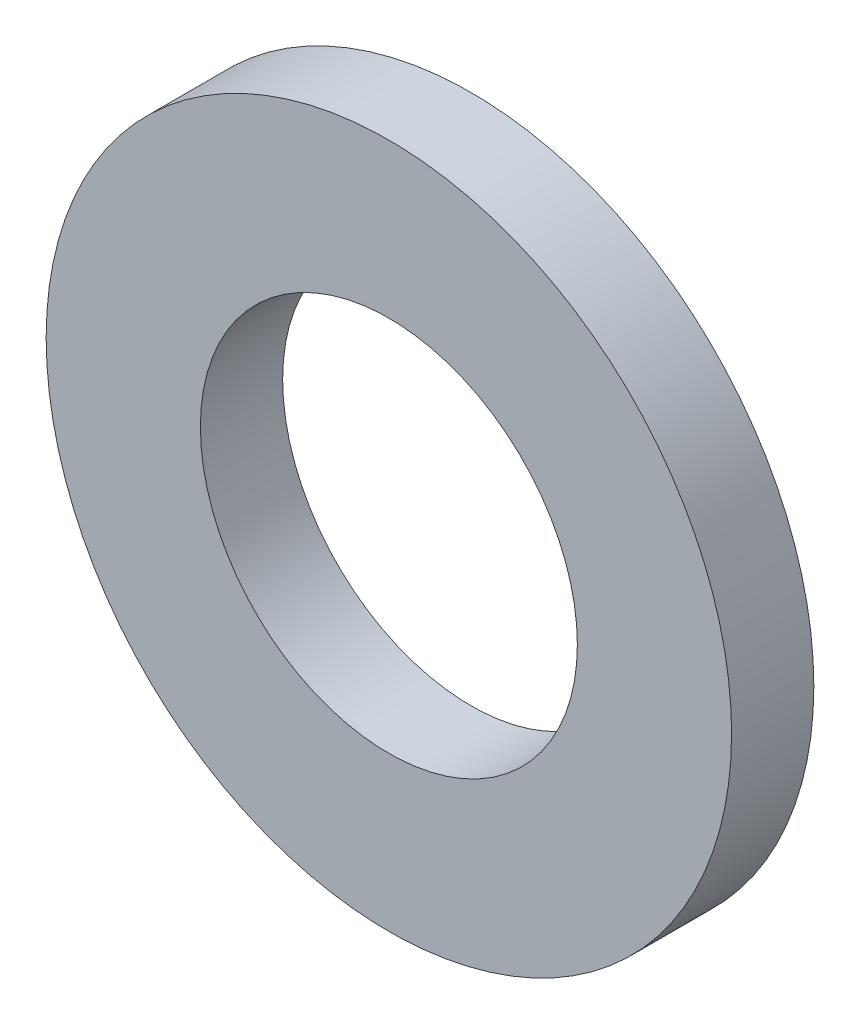
ISO-10303-21;
HEADER;
FILE_DESCRIPTION(('STEP AP214'),'2;1');
FILE_NAME('part.step','',(''),(''),'','','');
FILE_SCHEMA(('AUTOMOTIVE_DESIGN { 1 0 10303 214 1 1 1 1 }'));
ENDSEC;
DATA;
#1=APPLICATION_CONTEXT('core data for automotive mechanical design processes');
#2=APPLICATION_PROTOCOL_DEFINITION('international standard','automotive_design',2000,#1);
#3=PRODUCT_CONTEXT('',#1,'mechanical');
#4=PRODUCT('Part','Part','',(#3));
#5=PRODUCT_RELATED_PRODUCT_CATEGORY('part','',(#4));
#6=PRODUCT_DEFINITION_FORMATION('','',#4);
#7=PRODUCT_DEFINITION_CONTEXT('part definition',#1,'design');
#8=PRODUCT_DEFINITION('design','',#6,#7);
#9=PRODUCT_DEFINITION_SHAPE('','',#8);
#10=(LENGTH_UNIT() NAMED_UNIT(*) SI_UNIT(.MILLI.,.METRE.));
#11=(NAMED_UNIT(*) PLANE_ANGLE_UNIT() SI_UNIT($,.RADIAN.));
#12=(NAMED_UNIT(*) SI_UNIT($,.STERADIAN.) SOLID_ANGLE_UNIT());
#13=UNCERTAINTY_MEASURE_WITH_UNIT(LENGTH_MEASURE(1.E-05),#10,'distance_accuracy_value','');
#14=(GEOMETRIC_REPRESENTATION_CONTEXT(3) GLOBAL_UNCERTAINTY_ASSIGNED_CONTEXT((#13)) GLOBAL_UNIT_ASSIGNED_CONTEXT((#10,
#11,#12)) REPRESENTATION_CONTEXT('',''));
#15=CARTESIAN_POINT('',(0.,0.,0.));
#16=DIRECTION('',(0.,0.,1.));
#17=DIRECTION('',(1.,0.,0.));
#18=AXIS2_PLACEMENT_3D('',#15,#16,#17);
#19=CARTESIAN_POINT('',(0.,0.,1.19999999999998));
#20=DIRECTION('',(0.,0.,1.));
#21=DIRECTION('',(1.,0.,0.));
#22=AXIS2_PLACEMENT_3D('',#19,#20,#21);
#23=PLANE('',#22);
#24=CARTESIAN_POINT('',(0.,0.,1.19999999999998));
#25=DIRECTION('',(0.,0.,1.));
#26=DIRECTION('',(1.,0.,0.));
#27=AXIS2_PLACEMENT_3D('',#24,#25,#26);
#28=CIRCLE('',#27,5.);
#29=CARTESIAN_POINT('',(5.,0.,1.19999999999998));
#30=VERTEX_POINT('',#29);
#31=EDGE_CURVE('E10',#30,#30,#28,.T.);
#32=ORIENTED_EDGE('',*,*,#31,.T.);
#33=EDGE_LOOP('',(#32));
#34=FACE_BOUND('',#33,.T.);
#35=CARTESIAN_POINT('',(0.,0.,1.19999999999998));
#36=DIRECTION('',(0.,0.,1.));
#37=DIRECTION('',(1.,0.,0.));
#38=AXIS2_PLACEMENT_3D('',#35,#36,#37);
#39=CIRCLE('',#38,2.75);
#40=CARTESIAN_POINT('',(2.75,0.,1.19999999999998));
#41=VERTEX_POINT('',#40);
#42=EDGE_CURVE('E41',#41,#41,#39,.T.);
#43=ORIENTED_EDGE('',*,*,#42,.F.);
#44=EDGE_LOOP('',(#43));
#45=FACE_BOUND('',#44,.T.);
#46=ADVANCED_FACE('F30',(#34,#45),#23,.T.);
#47=CARTESIAN_POINT('',(0.,0.,0.));
#48=DIRECTION('',(0.,0.,1.));
#49=DIRECTION('',(1.,0.,0.));
#50=AXIS2_PLACEMENT_3D('',#47,#48,#49);
#51=PLANE('',#50);
#52=CARTESIAN_POINT('',(0.,0.,0.));
#53=DIRECTION('',(0.,0.,1.));
#54=DIRECTION('',(1.,0.,0.));
#55=AXIS2_PLACEMENT_3D('',#52,#53,#54);
#56=CIRCLE('',#55,5.);
#57=CARTESIAN_POINT('',(5.,0.,0.));
#58=VERTEX_POINT('',#57);
#59=EDGE_CURVE('E34',#58,#58,#56,.T.);
#60=ORIENTED_EDGE('',*,*,#59,.F.);
#61=EDGE_LOOP('',(#60));
#62=FACE_BOUND('',#61,.T.);
#63=CARTESIAN_POINT('',(0.,0.,0.));
#64=DIRECTION('',(0.,0.,1.));
#65=DIRECTION('',(1.,0.,0.));
#66=AXIS2_PLACEMENT_3D('',#63,#64,#65);
#67=CIRCLE('',#66,2.75);
#68=CARTESIAN_POINT('',(2.75,0.,0.));
#69=VERTEX_POINT('',#68);
#70=EDGE_CURVE('E43',#69,#69,#67,.T.);
#71=ORIENTED_EDGE('',*,*,#70,.T.);
#72=EDGE_LOOP('',(#71));
#73=FACE_BOUND('',#72,.T.);
#74=ADVANCED_FACE('F53',(#62,#73),#51,.F.);
#75=CARTESIAN_POINT('',(0.,0.,1.19999999999998));
#76=DIRECTION('',(0.,0.,-1.));
#77=DIRECTION('',(-1.,0.,0.));
#78=AXIS2_PLACEMENT_3D('',#75,#76,#77);
#79=CYLINDRICAL_SURFACE('',#78,5.);
#80=ORIENTED_EDGE('',*,*,#31,.F.);
#81=EDGE_LOOP('',(#80));
#82=FACE_BOUND('',#81,.T.);
#83=ORIENTED_EDGE('',*,*,#59,.T.);
#84=EDGE_LOOP('',(#83));
#85=FACE_BOUND('',#84,.T.);
#86=ADVANCED_FACE('F32',(#82,#85),#79,.T.);
#87=CARTESIAN_POINT('',(0.,0.,1.19999999999998));
#88=DIRECTION('',(0.,0.,-1.));
#89=DIRECTION('',(-1.,0.,0.));
#90=AXIS2_PLACEMENT_3D('',#87,#88,#89);
#91=CYLINDRICAL_SURFACE('',#90,2.75);
#92=ORIENTED_EDGE('',*,*,#42,.T.);
#93=EDGE_LOOP('',(#92));
#94=FACE_BOUND('',#93,.T.);
#95=ORIENTED_EDGE('',*,*,#70,.F.);
#96=EDGE_LOOP('',(#95));
#97=FACE_BOUND('',#96,.T.);
#98=ADVANCED_FACE('F49',(#94,#97),#91,.F.);
#99=CLOSED_SHELL('',(#46,#74,#86,#98));
#100=MANIFOLD_SOLID_BREP('B2',#99);
#101=ADVANCED_BREP_SHAPE_REPRESENTATION('',(#18,#100),#14);
#102=SHAPE_DEFINITION_REPRESENTATION(#9,#101);
ENDSEC;
END-ISO-10303-21;
